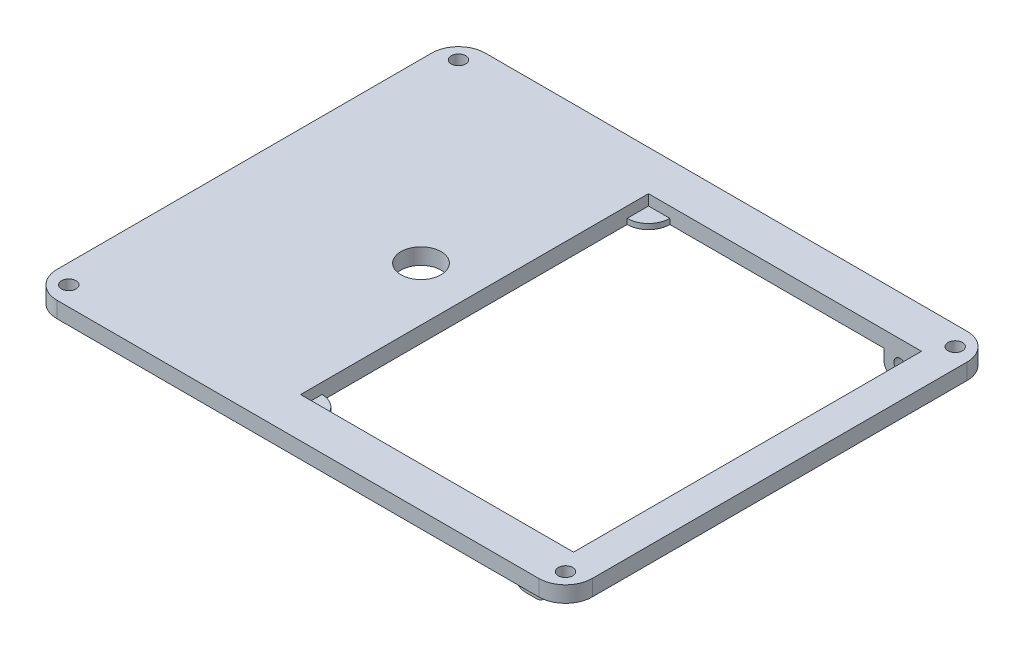
ISO-10303-21;
HEADER;
FILE_DESCRIPTION(('STEP AP214'),'2;1');
FILE_NAME('part.step','',(''),(''),'','','');
FILE_SCHEMA(('AUTOMOTIVE_DESIGN { 1 0 10303 214 1 1 1 1 }'));
ENDSEC;
DATA;
#1=APPLICATION_CONTEXT('core data for automotive mechanical design processes');
#2=APPLICATION_PROTOCOL_DEFINITION('international standard','automotive_design',2000,#1);
#3=PRODUCT_CONTEXT('',#1,'mechanical');
#4=PRODUCT('Part','Part','',(#3));
#5=PRODUCT_RELATED_PRODUCT_CATEGORY('part','',(#4));
#6=PRODUCT_DEFINITION_FORMATION('','',#4);
#7=PRODUCT_DEFINITION_CONTEXT('part definition',#1,'design');
#8=PRODUCT_DEFINITION('design','',#6,#7);
#9=PRODUCT_DEFINITION_SHAPE('','',#8);
#10=(LENGTH_UNIT() NAMED_UNIT(*) SI_UNIT(.MILLI.,.METRE.));
#11=(NAMED_UNIT(*) PLANE_ANGLE_UNIT() SI_UNIT($,.RADIAN.));
#12=(NAMED_UNIT(*) SI_UNIT($,.STERADIAN.) SOLID_ANGLE_UNIT());
#13=UNCERTAINTY_MEASURE_WITH_UNIT(LENGTH_MEASURE(1.E-05),#10,'distance_accuracy_value','');
#14=(GEOMETRIC_REPRESENTATION_CONTEXT(3) GLOBAL_UNCERTAINTY_ASSIGNED_CONTEXT((#13)) GLOBAL_UNIT_ASSIGNED_CONTEXT((#10,
#11,#12)) REPRESENTATION_CONTEXT('',''));
#15=CARTESIAN_POINT('',(0.,0.,0.));
#16=DIRECTION('',(0.,0.,1.));
#17=DIRECTION('',(1.,0.,0.));
#18=AXIS2_PLACEMENT_3D('',#15,#16,#17);
#19=CARTESIAN_POINT('',(40.,-1.3,36.5));
#20=DIRECTION('',(0.,0.,-1.));
#21=DIRECTION('',(-1.,0.,0.));
#22=AXIS2_PLACEMENT_3D('',#19,#20,#21);
#23=CYLINDRICAL_SURFACE('',#22,1.15);
#24=CARTESIAN_POINT('',(40.,-1.3,32.5));
#25=DIRECTION('',(0.,0.,1.));
#26=DIRECTION('',(1.,0.,0.));
#27=AXIS2_PLACEMENT_3D('',#24,#25,#26);
#28=CIRCLE('',#27,1.15);
#29=CARTESIAN_POINT('',(41.15,-1.3,32.5));
#30=VERTEX_POINT('',#29);
#31=EDGE_CURVE('E266',#30,#30,#28,.T.);
#32=ORIENTED_EDGE('',*,*,#31,.F.);
#33=EDGE_LOOP('',(#32));
#34=FACE_BOUND('',#33,.T.);
#35=CARTESIAN_POINT('',(40.,-1.3,34.5));
#36=DIRECTION('',(0.,0.,1.));
#37=DIRECTION('',(1.,0.,0.));
#38=AXIS2_PLACEMENT_3D('',#35,#36,#37);
#39=CIRCLE('',#38,1.15);
#40=CARTESIAN_POINT('',(41.15,-1.3,34.5));
#41=VERTEX_POINT('',#40);
#42=EDGE_CURVE('E241',#41,#41,#39,.T.);
#43=ORIENTED_EDGE('',*,*,#42,.T.);
#44=EDGE_LOOP('',(#43));
#45=FACE_BOUND('',#44,.T.);
#46=ADVANCED_FACE('F35',(#34,#45),#23,.F.);
#47=CARTESIAN_POINT('',(-45.,0.,35.));
#48=DIRECTION('',(0.,1.,0.));
#49=DIRECTION('',(0.,0.,1.));
#50=AXIS2_PLACEMENT_3D('',#47,#48,#49);
#51=PLANE('',#50);
#52=DIRECTION('',(-1.,0.,0.));
#53=VECTOR('',#52,1.);
#54=CARTESIAN_POINT('',(-6.99999999999999,0.,-32.5));
#55=LINE('',#54,#53);
#56=CARTESIAN_POINT('',(37.,0.,-32.5));
#57=VERTEX_POINT('',#56);
#58=CARTESIAN_POINT('',(-2.99999999999998,0.,-32.5));
#59=VERTEX_POINT('',#58);
#60=EDGE_CURVE('E362',#57,#59,#55,.T.);
#61=ORIENTED_EDGE('',*,*,#60,.T.);
#62=CARTESIAN_POINT('',(-6.99999999999998,0.,-32.5));
#63=DIRECTION('',(0.,-1.,0.));
#64=DIRECTION('',(0.,0.,1.));
#65=AXIS2_PLACEMENT_3D('',#62,#63,#64);
#66=CIRCLE('',#65,4.);
#67=CARTESIAN_POINT('',(-6.99999999999999,0.,-28.5));
#68=VERTEX_POINT('',#67);
#69=EDGE_CURVE('E50',#59,#68,#66,.T.);
#70=ORIENTED_EDGE('',*,*,#69,.T.);
#71=DIRECTION('',(0.,0.,1.));
#72=VECTOR('',#71,1.);
#73=CARTESIAN_POINT('',(-6.99999999999999,0.,-32.5));
#74=LINE('',#73,#72);
#75=CARTESIAN_POINT('',(-6.99999999999999,0.,28.5));
#76=VERTEX_POINT('',#75);
#77=EDGE_CURVE('E366',#68,#76,#74,.T.);
#78=ORIENTED_EDGE('',*,*,#77,.T.);
#79=CARTESIAN_POINT('',(-6.99999999999998,0.,32.5));
#80=DIRECTION('',(0.,-1.,0.));
#81=DIRECTION('',(0.,0.,-1.));
#82=AXIS2_PLACEMENT_3D('',#79,#80,#81);
#83=CIRCLE('',#82,4.);
#84=CARTESIAN_POINT('',(-2.99999999999998,0.,32.5));
#85=VERTEX_POINT('',#84);
#86=EDGE_CURVE('E56',#76,#85,#83,.T.);
#87=ORIENTED_EDGE('',*,*,#86,.T.);
#88=DIRECTION('',(1.,0.,0.));
#89=VECTOR('',#88,1.);
#90=CARTESIAN_POINT('',(-6.99999999999998,0.,32.5));
#91=LINE('',#90,#89);
#92=CARTESIAN_POINT('',(37.,0.,32.5));
#93=VERTEX_POINT('',#92);
#94=EDGE_CURVE('E352',#85,#93,#91,.T.);
#95=ORIENTED_EDGE('',*,*,#94,.T.);
#96=DIRECTION('',(0.,0.,1.));
#97=VECTOR('',#96,1.);
#98=CARTESIAN_POINT('',(37.,0.,32.5));
#99=LINE('',#98,#97);
#100=CARTESIAN_POINT('',(37.,0.,36.5));
#101=VERTEX_POINT('',#100);
#102=EDGE_CURVE('E276',#93,#101,#99,.T.);
#103=ORIENTED_EDGE('',*,*,#102,.T.);
#104=DIRECTION('',(1.,0.,0.));
#105=VECTOR('',#104,1.);
#106=CARTESIAN_POINT('',(43.,0.,36.5));
#107=LINE('',#106,#105);
#108=CARTESIAN_POINT('',(43.,0.,36.5));
#109=VERTEX_POINT('',#108);
#110=EDGE_CURVE('E282',#101,#109,#107,.T.);
#111=ORIENTED_EDGE('',*,*,#110,.T.);
#112=DIRECTION('',(0.,0.,-1.));
#113=VECTOR('',#112,1.);
#114=CARTESIAN_POINT('',(43.,0.,32.5));
#115=LINE('',#114,#113);
#116=CARTESIAN_POINT('',(43.,0.,32.5));
#117=VERTEX_POINT('',#116);
#118=EDGE_CURVE('E271',#109,#117,#115,.T.);
#119=ORIENTED_EDGE('',*,*,#118,.T.);
#120=CARTESIAN_POINT('',(44.,0.,32.5));
#121=VERTEX_POINT('',#120);
#122=EDGE_CURVE('E368',#117,#121,#91,.T.);
#123=ORIENTED_EDGE('',*,*,#122,.T.);
#124=DIRECTION('',(0.,0.,-1.));
#125=VECTOR('',#124,1.);
#126=CARTESIAN_POINT('',(44.,0.,-32.5));
#127=LINE('',#126,#125);
#128=CARTESIAN_POINT('',(44.,0.,-32.5));
#129=VERTEX_POINT('',#128);
#130=EDGE_CURVE('E346',#121,#129,#127,.T.);
#131=ORIENTED_EDGE('',*,*,#130,.T.);
#132=CARTESIAN_POINT('',(43.,0.,-32.5));
#133=VERTEX_POINT('',#132);
#134=EDGE_CURVE('E363',#129,#133,#55,.T.);
#135=ORIENTED_EDGE('',*,*,#134,.T.);
#136=DIRECTION('',(0.,0.,1.));
#137=VECTOR('',#136,1.);
#138=CARTESIAN_POINT('',(43.,0.,-32.5));
#139=LINE('',#138,#137);
#140=CARTESIAN_POINT('',(43.,0.,-36.5));
#141=VERTEX_POINT('',#140);
#142=EDGE_CURVE('E299',#141,#133,#139,.T.);
#143=ORIENTED_EDGE('',*,*,#142,.F.);
#144=DIRECTION('',(1.,0.,0.));
#145=VECTOR('',#144,1.);
#146=CARTESIAN_POINT('',(43.,0.,-36.5));
#147=LINE('',#146,#145);
#148=CARTESIAN_POINT('',(37.,0.,-36.5));
#149=VERTEX_POINT('',#148);
#150=EDGE_CURVE('E306',#149,#141,#147,.T.);
#151=ORIENTED_EDGE('',*,*,#150,.F.);
#152=DIRECTION('',(0.,0.,-1.));
#153=VECTOR('',#152,1.);
#154=CARTESIAN_POINT('',(37.,0.,-32.5));
#155=LINE('',#154,#153);
#156=EDGE_CURVE('E312',#57,#149,#155,.T.);
#157=ORIENTED_EDGE('',*,*,#156,.F.);
#158=EDGE_LOOP('',(#61,#70,#78,#87,#95,#103,#111,#119,#123,#131,#135,#143,#151,#157));
#159=FACE_BOUND('',#158,.T.);
#160=CARTESIAN_POINT('',(-17.,0.,0.));
#161=DIRECTION('',(0.,1.,0.));
#162=DIRECTION('',(0.,0.,1.));
#163=AXIS2_PLACEMENT_3D('',#160,#161,#162);
#164=CIRCLE('',#163,3.75);
#165=CARTESIAN_POINT('',(-17.,0.,3.75));
#166=VERTEX_POINT('',#165);
#167=EDGE_CURVE('E263',#166,#166,#164,.T.);
#168=ORIENTED_EDGE('',*,*,#167,.T.);
#169=EDGE_LOOP('',(#168));
#170=FACE_BOUND('',#169,.T.);
#171=CARTESIAN_POINT('',(-46.4,0.,36.4));
#172=DIRECTION('',(0.,1.,0.));
#173=DIRECTION('',(0.,0.,-1.));
#174=AXIS2_PLACEMENT_3D('',#171,#172,#173);
#175=CIRCLE('',#174,1.35);
#176=CARTESIAN_POINT('',(-46.4,0.,35.05));
#177=VERTEX_POINT('',#176);
#178=EDGE_CURVE('E324',#177,#177,#175,.T.);
#179=ORIENTED_EDGE('',*,*,#178,.T.);
#180=EDGE_LOOP('',(#179));
#181=FACE_BOUND('',#180,.T.);
#182=CARTESIAN_POINT('',(46.4,0.,36.4));
#183=DIRECTION('',(0.,1.,0.));
#184=DIRECTION('',(0.,0.,1.));
#185=AXIS2_PLACEMENT_3D('',#182,#183,#184);
#186=CIRCLE('',#185,1.35);
#187=CARTESIAN_POINT('',(46.4,0.,37.75));
#188=VERTEX_POINT('',#187);
#189=EDGE_CURVE('E328',#188,#188,#186,.T.);
#190=ORIENTED_EDGE('',*,*,#189,.T.);
#191=EDGE_LOOP('',(#190));
#192=FACE_BOUND('',#191,.T.);
#193=CARTESIAN_POINT('',(46.4,0.,-36.4));
#194=DIRECTION('',(0.,1.,0.));
#195=DIRECTION('',(0.,0.,-1.));
#196=AXIS2_PLACEMENT_3D('',#193,#194,#195);
#197=CIRCLE('',#196,1.35);
#198=CARTESIAN_POINT('',(46.4,0.,-37.75));
#199=VERTEX_POINT('',#198);
#200=EDGE_CURVE('E334',#199,#199,#197,.T.);
#201=ORIENTED_EDGE('',*,*,#200,.T.);
#202=EDGE_LOOP('',(#201));
#203=FACE_BOUND('',#202,.T.);
#204=CARTESIAN_POINT('',(-46.4,0.,-36.4));
#205=DIRECTION('',(0.,1.,0.));
#206=DIRECTION('',(0.,0.,1.));
#207=AXIS2_PLACEMENT_3D('',#204,#205,#206);
#208=CIRCLE('',#207,1.35);
#209=CARTESIAN_POINT('',(-46.4,0.,-35.05));
#210=VERTEX_POINT('',#209);
#211=EDGE_CURVE('E340',#210,#210,#208,.T.);
#212=ORIENTED_EDGE('',*,*,#211,.T.);
#213=EDGE_LOOP('',(#212));
#214=FACE_BOUND('',#213,.T.);
#215=CARTESIAN_POINT('',(-45.,0.,35.));
#216=DIRECTION('',(0.,1.,0.));
#217=DIRECTION('',(0.,0.,1.));
#218=AXIS2_PLACEMENT_3D('',#215,#216,#217);
#219=CIRCLE('',#218,5.);
#220=CARTESIAN_POINT('',(-50.,0.,35.));
#221=VERTEX_POINT('',#220);
#222=CARTESIAN_POINT('',(-45.,0.,40.));
#223=VERTEX_POINT('',#222);
#224=EDGE_CURVE('E379',#221,#223,#219,.T.);
#225=ORIENTED_EDGE('',*,*,#224,.F.);
#226=DIRECTION('',(0.,0.,1.));
#227=VECTOR('',#226,1.);
#228=CARTESIAN_POINT('',(-50.,0.,-35.));
#229=LINE('',#228,#227);
#230=CARTESIAN_POINT('',(-50.,0.,-35.));
#231=VERTEX_POINT('',#230);
#232=EDGE_CURVE('E384',#231,#221,#229,.T.);
#233=ORIENTED_EDGE('',*,*,#232,.F.);
#234=CARTESIAN_POINT('',(-45.,0.,-35.));
#235=DIRECTION('',(0.,1.,0.));
#236=DIRECTION('',(0.,0.,1.));
#237=AXIS2_PLACEMENT_3D('',#234,#235,#236);
#238=CIRCLE('',#237,5.);
#239=CARTESIAN_POINT('',(-45.,0.,-40.));
#240=VERTEX_POINT('',#239);
#241=EDGE_CURVE('E411',#240,#231,#238,.T.);
#242=ORIENTED_EDGE('',*,*,#241,.F.);
#243=DIRECTION('',(-1.,0.,0.));
#244=VECTOR('',#243,1.);
#245=CARTESIAN_POINT('',(-45.,0.,-40.));
#246=LINE('',#245,#244);
#247=CARTESIAN_POINT('',(45.,0.,-40.));
#248=VERTEX_POINT('',#247);
#249=EDGE_CURVE('E409',#248,#240,#246,.T.);
#250=ORIENTED_EDGE('',*,*,#249,.F.);
#251=CARTESIAN_POINT('',(45.,0.,-35.));
#252=DIRECTION('',(0.,1.,0.));
#253=DIRECTION('',(0.,0.,-1.));
#254=AXIS2_PLACEMENT_3D('',#251,#252,#253);
#255=CIRCLE('',#254,5.);
#256=CARTESIAN_POINT('',(50.,0.,-35.));
#257=VERTEX_POINT('',#256);
#258=EDGE_CURVE('E407',#257,#248,#255,.T.);
#259=ORIENTED_EDGE('',*,*,#258,.F.);
#260=DIRECTION('',(0.,0.,-1.));
#261=VECTOR('',#260,1.);
#262=CARTESIAN_POINT('',(50.,0.,-35.));
#263=LINE('',#262,#261);
#264=CARTESIAN_POINT('',(50.,0.,35.));
#265=VERTEX_POINT('',#264);
#266=EDGE_CURVE('E405',#265,#257,#263,.T.);
#267=ORIENTED_EDGE('',*,*,#266,.F.);
#268=CARTESIAN_POINT('',(45.,0.,35.));
#269=DIRECTION('',(0.,1.,0.));
#270=DIRECTION('',(0.,0.,1.));
#271=AXIS2_PLACEMENT_3D('',#268,#269,#270);
#272=CIRCLE('',#271,5.);
#273=CARTESIAN_POINT('',(45.,0.,40.));
#274=VERTEX_POINT('',#273);
#275=EDGE_CURVE('E403',#274,#265,#272,.T.);
#276=ORIENTED_EDGE('',*,*,#275,.F.);
#277=DIRECTION('',(1.,0.,0.));
#278=VECTOR('',#277,1.);
#279=CARTESIAN_POINT('',(-45.,0.,40.));
#280=LINE('',#279,#278);
#281=EDGE_CURVE('E401',#223,#274,#280,.T.);
#282=ORIENTED_EDGE('',*,*,#281,.F.);
#283=EDGE_LOOP('',(#225,#233,#242,#250,#259,#267,#276,#282));
#284=FACE_BOUND('',#283,.T.);
#285=ADVANCED_FACE('F499',(#159,#170,#181,#192,#203,#214,#284),#51,.F.);
#286=CARTESIAN_POINT('',(-45.,3.,35.));
#287=DIRECTION('',(0.,1.,0.));
#288=DIRECTION('',(0.,0.,1.));
#289=AXIS2_PLACEMENT_3D('',#286,#287,#288);
#290=PLANE('',#289);
#291=CARTESIAN_POINT('',(-17.,3.,0.));
#292=DIRECTION('',(0.,1.,0.));
#293=DIRECTION('',(0.,0.,1.));
#294=AXIS2_PLACEMENT_3D('',#291,#292,#293);
#295=CIRCLE('',#294,3.75);
#296=CARTESIAN_POINT('',(-17.,3.,3.75));
#297=VERTEX_POINT('',#296);
#298=EDGE_CURVE('E260',#297,#297,#295,.T.);
#299=ORIENTED_EDGE('',*,*,#298,.F.);
#300=EDGE_LOOP('',(#299));
#301=FACE_BOUND('',#300,.T.);
#302=CARTESIAN_POINT('',(46.4,3.,36.4));
#303=DIRECTION('',(0.,1.,0.));
#304=DIRECTION('',(0.,0.,1.));
#305=AXIS2_PLACEMENT_3D('',#302,#303,#304);
#306=CIRCLE('',#305,1.35);
#307=CARTESIAN_POINT('',(46.4,3.,37.75));
#308=VERTEX_POINT('',#307);
#309=EDGE_CURVE('E331',#308,#308,#306,.T.);
#310=ORIENTED_EDGE('',*,*,#309,.F.);
#311=EDGE_LOOP('',(#310));
#312=FACE_BOUND('',#311,.T.);
#313=CARTESIAN_POINT('',(-46.4,3.,-36.4));
#314=DIRECTION('',(0.,1.,0.));
#315=DIRECTION('',(0.,0.,1.));
#316=AXIS2_PLACEMENT_3D('',#313,#314,#315);
#317=CIRCLE('',#316,1.35);
#318=CARTESIAN_POINT('',(-46.4,3.,-35.05));
#319=VERTEX_POINT('',#318);
#320=EDGE_CURVE('E343',#319,#319,#317,.T.);
#321=ORIENTED_EDGE('',*,*,#320,.F.);
#322=EDGE_LOOP('',(#321));
#323=FACE_BOUND('',#322,.T.);
#324=CARTESIAN_POINT('',(-45.,3.,35.));
#325=DIRECTION('',(0.,1.,0.));
#326=DIRECTION('',(0.,0.,1.));
#327=AXIS2_PLACEMENT_3D('',#324,#325,#326);
#328=CIRCLE('',#327,5.);
#329=CARTESIAN_POINT('',(-50.,3.,35.));
#330=VERTEX_POINT('',#329);
#331=CARTESIAN_POINT('',(-45.,3.,40.));
#332=VERTEX_POINT('',#331);
#333=EDGE_CURVE('E380',#330,#332,#328,.T.);
#334=ORIENTED_EDGE('',*,*,#333,.T.);
#335=DIRECTION('',(1.,0.,0.));
#336=VECTOR('',#335,1.);
#337=CARTESIAN_POINT('',(-45.,3.,40.));
#338=LINE('',#337,#336);
#339=CARTESIAN_POINT('',(45.,3.,40.));
#340=VERTEX_POINT('',#339);
#341=EDGE_CURVE('E383',#332,#340,#338,.T.);
#342=ORIENTED_EDGE('',*,*,#341,.T.);
#343=CARTESIAN_POINT('',(45.,3.,35.));
#344=DIRECTION('',(0.,1.,0.));
#345=DIRECTION('',(0.,0.,1.));
#346=AXIS2_PLACEMENT_3D('',#343,#344,#345);
#347=CIRCLE('',#346,5.);
#348=CARTESIAN_POINT('',(50.,3.,35.));
#349=VERTEX_POINT('',#348);
#350=EDGE_CURVE('E386',#340,#349,#347,.T.);
#351=ORIENTED_EDGE('',*,*,#350,.T.);
#352=DIRECTION('',(0.,0.,-1.));
#353=VECTOR('',#352,1.);
#354=CARTESIAN_POINT('',(50.,3.,-35.));
#355=LINE('',#354,#353);
#356=CARTESIAN_POINT('',(50.,3.,-35.));
#357=VERTEX_POINT('',#356);
#358=EDGE_CURVE('E388',#349,#357,#355,.T.);
#359=ORIENTED_EDGE('',*,*,#358,.T.);
#360=CARTESIAN_POINT('',(45.,3.,-35.));
#361=DIRECTION('',(0.,1.,0.));
#362=DIRECTION('',(0.,0.,-1.));
#363=AXIS2_PLACEMENT_3D('',#360,#361,#362);
#364=CIRCLE('',#363,5.);
#365=CARTESIAN_POINT('',(45.,3.,-40.));
#366=VERTEX_POINT('',#365);
#367=EDGE_CURVE('E390',#357,#366,#364,.T.);
#368=ORIENTED_EDGE('',*,*,#367,.T.);
#369=DIRECTION('',(-1.,0.,0.));
#370=VECTOR('',#369,1.);
#371=CARTESIAN_POINT('',(-45.,3.,-40.));
#372=LINE('',#371,#370);
#373=CARTESIAN_POINT('',(-45.,3.,-40.));
#374=VERTEX_POINT('',#373);
#375=EDGE_CURVE('E392',#366,#374,#372,.T.);
#376=ORIENTED_EDGE('',*,*,#375,.T.);
#377=CARTESIAN_POINT('',(-45.,3.,-35.));
#378=DIRECTION('',(0.,1.,0.));
#379=DIRECTION('',(0.,0.,1.));
#380=AXIS2_PLACEMENT_3D('',#377,#378,#379);
#381=CIRCLE('',#380,5.);
#382=CARTESIAN_POINT('',(-50.,3.,-35.));
#383=VERTEX_POINT('',#382);
#384=EDGE_CURVE('E394',#374,#383,#381,.T.);
#385=ORIENTED_EDGE('',*,*,#384,.T.);
#386=DIRECTION('',(0.,0.,1.));
#387=VECTOR('',#386,1.);
#388=CARTESIAN_POINT('',(-50.,3.,-35.));
#389=LINE('',#388,#387);
#390=EDGE_CURVE('E396',#383,#330,#389,.T.);
#391=ORIENTED_EDGE('',*,*,#390,.T.);
#392=EDGE_LOOP('',(#334,#342,#351,#359,#368,#376,#385,#391));
#393=FACE_BOUND('',#392,.T.);
#394=DIRECTION('',(-1.,0.,0.));
#395=VECTOR('',#394,1.);
#396=CARTESIAN_POINT('',(-6.99999999999999,3.,-32.5));
#397=LINE('',#396,#395);
#398=CARTESIAN_POINT('',(44.,3.,-32.5));
#399=VERTEX_POINT('',#398);
#400=CARTESIAN_POINT('',(-6.99999999999999,3.,-32.5));
#401=VERTEX_POINT('',#400);
#402=EDGE_CURVE('E351',#399,#401,#397,.T.);
#403=ORIENTED_EDGE('',*,*,#402,.F.);
#404=DIRECTION('',(0.,0.,-1.));
#405=VECTOR('',#404,1.);
#406=CARTESIAN_POINT('',(44.,3.,-32.5));
#407=LINE('',#406,#405);
#408=CARTESIAN_POINT('',(44.,3.,32.5));
#409=VERTEX_POINT('',#408);
#410=EDGE_CURVE('E349',#409,#399,#407,.T.);
#411=ORIENTED_EDGE('',*,*,#410,.F.);
#412=DIRECTION('',(1.,0.,0.));
#413=VECTOR('',#412,1.);
#414=CARTESIAN_POINT('',(-6.99999999999998,3.,32.5));
#415=LINE('',#414,#413);
#416=CARTESIAN_POINT('',(-6.99999999999998,3.,32.5));
#417=VERTEX_POINT('',#416);
#418=EDGE_CURVE('E357',#417,#409,#415,.T.);
#419=ORIENTED_EDGE('',*,*,#418,.F.);
#420=DIRECTION('',(0.,0.,1.));
#421=VECTOR('',#420,1.);
#422=CARTESIAN_POINT('',(-6.99999999999999,3.,-32.5));
#423=LINE('',#422,#421);
#424=EDGE_CURVE('E354',#401,#417,#423,.T.);
#425=ORIENTED_EDGE('',*,*,#424,.F.);
#426=EDGE_LOOP('',(#403,#411,#419,#425));
#427=FACE_BOUND('',#426,.T.);
#428=CARTESIAN_POINT('',(46.4,3.,-36.4));
#429=DIRECTION('',(0.,1.,0.));
#430=DIRECTION('',(0.,0.,-1.));
#431=AXIS2_PLACEMENT_3D('',#428,#429,#430);
#432=CIRCLE('',#431,1.35);
#433=CARTESIAN_POINT('',(46.4,3.,-37.75));
#434=VERTEX_POINT('',#433);
#435=EDGE_CURVE('E337',#434,#434,#432,.T.);
#436=ORIENTED_EDGE('',*,*,#435,.F.);
#437=EDGE_LOOP('',(#436));
#438=FACE_BOUND('',#437,.T.);
#439=CARTESIAN_POINT('',(-46.4,3.,36.4));
#440=DIRECTION('',(0.,1.,0.));
#441=DIRECTION('',(0.,0.,-1.));
#442=AXIS2_PLACEMENT_3D('',#439,#440,#441);
#443=CIRCLE('',#442,1.35);
#444=CARTESIAN_POINT('',(-46.4,3.,35.05));
#445=VERTEX_POINT('',#444);
#446=EDGE_CURVE('E325',#445,#445,#443,.T.);
#447=ORIENTED_EDGE('',*,*,#446,.F.);
#448=EDGE_LOOP('',(#447));
#449=FACE_BOUND('',#448,.T.);
#450=ADVANCED_FACE('F519',(#301,#312,#323,#393,#427,#438,#449),#290,.T.);
#451=CARTESIAN_POINT('',(-45.,3.,35.));
#452=DIRECTION('',(0.,-1.,0.));
#453=DIRECTION('',(0.,0.,-1.));
#454=AXIS2_PLACEMENT_3D('',#451,#452,#453);
#455=CYLINDRICAL_SURFACE('',#454,5.);
#456=ORIENTED_EDGE('',*,*,#224,.T.);
#457=DIRECTION('',(0.,-1.,0.));
#458=VECTOR('',#457,1.);
#459=CARTESIAN_POINT('',(-45.,3.,40.));
#460=LINE('',#459,#458);
#461=EDGE_CURVE('E434',#332,#223,#460,.T.);
#462=ORIENTED_EDGE('',*,*,#461,.F.);
#463=ORIENTED_EDGE('',*,*,#333,.F.);
#464=DIRECTION('',(0.,-1.,0.));
#465=VECTOR('',#464,1.);
#466=CARTESIAN_POINT('',(-50.,3.,35.));
#467=LINE('',#466,#465);
#468=EDGE_CURVE('E398',#330,#221,#467,.T.);
#469=ORIENTED_EDGE('',*,*,#468,.T.);
#470=EDGE_LOOP('',(#456,#462,#463,#469));
#471=FACE_BOUND('',#470,.T.);
#472=ADVANCED_FACE('F797',(#471),#455,.T.);
#473=CARTESIAN_POINT('',(-45.,3.,40.));
#474=DIRECTION('',(0.,0.,-1.));
#475=DIRECTION('',(-1.,0.,0.));
#476=AXIS2_PLACEMENT_3D('',#473,#474,#475);
#477=PLANE('',#476);
#478=ORIENTED_EDGE('',*,*,#281,.T.);
#479=DIRECTION('',(0.,-1.,0.));
#480=VECTOR('',#479,1.);
#481=CARTESIAN_POINT('',(45.,3.,40.));
#482=LINE('',#481,#480);
#483=EDGE_CURVE('E431',#340,#274,#482,.T.);
#484=ORIENTED_EDGE('',*,*,#483,.F.);
#485=ORIENTED_EDGE('',*,*,#341,.F.);
#486=ORIENTED_EDGE('',*,*,#461,.T.);
#487=EDGE_LOOP('',(#478,#484,#485,#486));
#488=FACE_BOUND('',#487,.T.);
#489=ADVANCED_FACE('F822',(#488),#477,.F.);
#490=CARTESIAN_POINT('',(45.,3.,35.));
#491=DIRECTION('',(0.,-1.,0.));
#492=DIRECTION('',(0.,0.,-1.));
#493=AXIS2_PLACEMENT_3D('',#490,#491,#492);
#494=CYLINDRICAL_SURFACE('',#493,5.);
#495=ORIENTED_EDGE('',*,*,#275,.T.);
#496=DIRECTION('',(0.,-1.,0.));
#497=VECTOR('',#496,1.);
#498=CARTESIAN_POINT('',(50.,3.,35.));
#499=LINE('',#498,#497);
#500=EDGE_CURVE('E428',#349,#265,#499,.T.);
#501=ORIENTED_EDGE('',*,*,#500,.F.);
#502=ORIENTED_EDGE('',*,*,#350,.F.);
#503=ORIENTED_EDGE('',*,*,#483,.T.);
#504=EDGE_LOOP('',(#495,#501,#502,#503));
#505=FACE_BOUND('',#504,.T.);
#506=ADVANCED_FACE('F818',(#505),#494,.T.);
#507=CARTESIAN_POINT('',(50.,3.,-35.));
#508=DIRECTION('',(-1.,0.,0.));
#509=DIRECTION('',(0.,0.,1.));
#510=AXIS2_PLACEMENT_3D('',#507,#508,#509);
#511=PLANE('',#510);
#512=ORIENTED_EDGE('',*,*,#266,.T.);
#513=DIRECTION('',(0.,-1.,0.));
#514=VECTOR('',#513,1.);
#515=CARTESIAN_POINT('',(50.,3.,-35.));
#516=LINE('',#515,#514);
#517=EDGE_CURVE('E425',#357,#257,#516,.T.);
#518=ORIENTED_EDGE('',*,*,#517,.F.);
#519=ORIENTED_EDGE('',*,*,#358,.F.);
#520=ORIENTED_EDGE('',*,*,#500,.T.);
#521=EDGE_LOOP('',(#512,#518,#519,#520));
#522=FACE_BOUND('',#521,.T.);
#523=ADVANCED_FACE('F814',(#522),#511,.F.);
#524=CARTESIAN_POINT('',(45.,3.,-35.));
#525=DIRECTION('',(0.,-1.,0.));
#526=DIRECTION('',(0.,0.,-1.));
#527=AXIS2_PLACEMENT_3D('',#524,#525,#526);
#528=CYLINDRICAL_SURFACE('',#527,5.);
#529=ORIENTED_EDGE('',*,*,#258,.T.);
#530=DIRECTION('',(0.,-1.,0.));
#531=VECTOR('',#530,1.);
#532=CARTESIAN_POINT('',(45.,3.,-40.));
#533=LINE('',#532,#531);
#534=EDGE_CURVE('E422',#366,#248,#533,.T.);
#535=ORIENTED_EDGE('',*,*,#534,.F.);
#536=ORIENTED_EDGE('',*,*,#367,.F.);
#537=ORIENTED_EDGE('',*,*,#517,.T.);
#538=EDGE_LOOP('',(#529,#535,#536,#537));
#539=FACE_BOUND('',#538,.T.);
#540=ADVANCED_FACE('F810',(#539),#528,.T.);
#541=CARTESIAN_POINT('',(-45.,3.,-40.));
#542=DIRECTION('',(0.,0.,1.));
#543=DIRECTION('',(1.,0.,0.));
#544=AXIS2_PLACEMENT_3D('',#541,#542,#543);
#545=PLANE('',#544);
#546=ORIENTED_EDGE('',*,*,#249,.T.);
#547=DIRECTION('',(0.,-1.,0.));
#548=VECTOR('',#547,1.);
#549=CARTESIAN_POINT('',(-45.,3.,-40.));
#550=LINE('',#549,#548);
#551=EDGE_CURVE('E419',#374,#240,#550,.T.);
#552=ORIENTED_EDGE('',*,*,#551,.F.);
#553=ORIENTED_EDGE('',*,*,#375,.F.);
#554=ORIENTED_EDGE('',*,*,#534,.T.);
#555=EDGE_LOOP('',(#546,#552,#553,#554));
#556=FACE_BOUND('',#555,.T.);
#557=ADVANCED_FACE('F806',(#556),#545,.F.);
#558=CARTESIAN_POINT('',(-45.,3.,-35.));
#559=DIRECTION('',(0.,-1.,0.));
#560=DIRECTION('',(0.,0.,-1.));
#561=AXIS2_PLACEMENT_3D('',#558,#559,#560);
#562=CYLINDRICAL_SURFACE('',#561,5.);
#563=ORIENTED_EDGE('',*,*,#241,.T.);
#564=DIRECTION('',(0.,-1.,0.));
#565=VECTOR('',#564,1.);
#566=CARTESIAN_POINT('',(-50.,3.,-35.));
#567=LINE('',#566,#565);
#568=EDGE_CURVE('E416',#383,#231,#567,.T.);
#569=ORIENTED_EDGE('',*,*,#568,.F.);
#570=ORIENTED_EDGE('',*,*,#384,.F.);
#571=ORIENTED_EDGE('',*,*,#551,.T.);
#572=EDGE_LOOP('',(#563,#569,#570,#571));
#573=FACE_BOUND('',#572,.T.);
#574=ADVANCED_FACE('F802',(#573),#562,.T.);
#575=CARTESIAN_POINT('',(-50.,3.,-35.));
#576=DIRECTION('',(1.,0.,0.));
#577=DIRECTION('',(0.,0.,-1.));
#578=AXIS2_PLACEMENT_3D('',#575,#576,#577);
#579=PLANE('',#578);
#580=ORIENTED_EDGE('',*,*,#232,.T.);
#581=ORIENTED_EDGE('',*,*,#468,.F.);
#582=ORIENTED_EDGE('',*,*,#390,.F.);
#583=ORIENTED_EDGE('',*,*,#568,.T.);
#584=EDGE_LOOP('',(#580,#581,#582,#583));
#585=FACE_BOUND('',#584,.T.);
#586=ADVANCED_FACE('F796',(#585),#579,.F.);
#587=CARTESIAN_POINT('',(44.,3.,-32.5));
#588=DIRECTION('',(-1.,0.,0.));
#589=DIRECTION('',(0.,0.,1.));
#590=AXIS2_PLACEMENT_3D('',#587,#588,#589);
#591=PLANE('',#590);
#592=ORIENTED_EDGE('',*,*,#130,.F.);
#593=DIRECTION('',(0.,-1.,0.));
#594=VECTOR('',#593,1.);
#595=CARTESIAN_POINT('',(44.,3.,32.5));
#596=LINE('',#595,#594);
#597=EDGE_CURVE('E359',#409,#121,#596,.T.);
#598=ORIENTED_EDGE('',*,*,#597,.F.);
#599=ORIENTED_EDGE('',*,*,#410,.T.);
#600=DIRECTION('',(0.,-1.,0.));
#601=VECTOR('',#600,1.);
#602=CARTESIAN_POINT('',(44.,3.,-32.5));
#603=LINE('',#602,#601);
#604=EDGE_CURVE('E376',#399,#129,#603,.T.);
#605=ORIENTED_EDGE('',*,*,#604,.T.);
#606=EDGE_LOOP('',(#592,#598,#599,#605));
#607=FACE_BOUND('',#606,.T.);
#608=ADVANCED_FACE('F516',(#607),#591,.T.);
#609=CARTESIAN_POINT('',(-6.99999999999999,3.,-32.5));
#610=DIRECTION('',(0.,0.,1.));
#611=DIRECTION('',(1.,0.,0.));
#612=AXIS2_PLACEMENT_3D('',#609,#610,#611);
#613=PLANE('',#612);
#614=DIRECTION('',(0.,-1.,0.));
#615=VECTOR('',#614,1.);
#616=CARTESIAN_POINT('',(-2.99999999999998,1.,-32.5));
#617=LINE('',#616,#615);
#618=CARTESIAN_POINT('',(-2.99999999999998,1.,-32.5));
#619=VERTEX_POINT('',#618);
#620=EDGE_CURVE('E218',#619,#59,#617,.T.);
#621=ORIENTED_EDGE('',*,*,#620,.T.);
#622=ORIENTED_EDGE('',*,*,#60,.F.);
#623=DIRECTION('',(0.,1.,0.));
#624=VECTOR('',#623,1.);
#625=CARTESIAN_POINT('',(37.,-4.,-32.5));
#626=LINE('',#625,#624);
#627=CARTESIAN_POINT('',(37.,-2.,-32.5));
#628=VERTEX_POINT('',#627);
#629=EDGE_CURVE('E320',#628,#57,#626,.T.);
#630=ORIENTED_EDGE('',*,*,#629,.F.);
#631=CARTESIAN_POINT('',(39.,-2.,-32.5));
#632=DIRECTION('',(0.,0.,1.));
#633=DIRECTION('',(1.,0.,0.));
#634=AXIS2_PLACEMENT_3D('',#631,#632,#633);
#635=CIRCLE('',#634,2.);
#636=CARTESIAN_POINT('',(39.,-4.,-32.5));
#637=VERTEX_POINT('',#636);
#638=EDGE_CURVE('E443',#628,#637,#635,.T.);
#639=ORIENTED_EDGE('',*,*,#638,.T.);
#640=DIRECTION('',(-1.,0.,0.));
#641=VECTOR('',#640,1.);
#642=CARTESIAN_POINT('',(43.,-4.,-32.5));
#643=LINE('',#642,#641);
#644=CARTESIAN_POINT('',(41.,-4.,-32.5));
#645=VERTEX_POINT('',#644);
#646=EDGE_CURVE('E302',#645,#637,#643,.T.);
#647=ORIENTED_EDGE('',*,*,#646,.F.);
#648=CARTESIAN_POINT('',(41.,-2.,-32.5));
#649=DIRECTION('',(0.,0.,1.));
#650=DIRECTION('',(1.,0.,0.));
#651=AXIS2_PLACEMENT_3D('',#648,#649,#650);
#652=CIRCLE('',#651,2.);
#653=CARTESIAN_POINT('',(43.,-2.,-32.5));
#654=VERTEX_POINT('',#653);
#655=EDGE_CURVE('E445',#645,#654,#652,.T.);
#656=ORIENTED_EDGE('',*,*,#655,.T.);
#657=DIRECTION('',(0.,1.,0.));
#658=VECTOR('',#657,1.);
#659=CARTESIAN_POINT('',(43.,-4.,-32.5));
#660=LINE('',#659,#658);
#661=EDGE_CURVE('E322',#654,#133,#660,.T.);
#662=ORIENTED_EDGE('',*,*,#661,.T.);
#663=ORIENTED_EDGE('',*,*,#134,.F.);
#664=ORIENTED_EDGE('',*,*,#604,.F.);
#665=ORIENTED_EDGE('',*,*,#402,.T.);
#666=DIRECTION('',(0.,-1.,0.));
#667=VECTOR('',#666,1.);
#668=CARTESIAN_POINT('',(-6.99999999999999,3.,-32.5));
#669=LINE('',#668,#667);
#670=CARTESIAN_POINT('',(-6.99999999999998,1.,-32.5));
#671=VERTEX_POINT('',#670);
#672=EDGE_CURVE('E239',#401,#671,#669,.T.);
#673=ORIENTED_EDGE('',*,*,#672,.T.);
#674=DIRECTION('',(1.,0.,0.));
#675=VECTOR('',#674,1.);
#676=CARTESIAN_POINT('',(-6.99999999999998,1.,-32.5));
#677=LINE('',#676,#675);
#678=EDGE_CURVE('E231',#671,#619,#677,.T.);
#679=ORIENTED_EDGE('',*,*,#678,.T.);
#680=EDGE_LOOP('',(#621,#622,#630,#639,#647,#656,#662,#663,#664,#665,#673,#679));
#681=FACE_BOUND('',#680,.T.);
#682=CARTESIAN_POINT('',(40.,-1.3,-32.5));
#683=DIRECTION('',(0.,0.,1.));
#684=DIRECTION('',(1.,0.,0.));
#685=AXIS2_PLACEMENT_3D('',#682,#683,#684);
#686=CIRCLE('',#685,1.15);
#687=CARTESIAN_POINT('',(41.15,-1.3,-32.5));
#688=VERTEX_POINT('',#687);
#689=EDGE_CURVE('E295',#688,#688,#686,.T.);
#690=ORIENTED_EDGE('',*,*,#689,.F.);
#691=EDGE_LOOP('',(#690));
#692=FACE_BOUND('',#691,.T.);
#693=ADVANCED_FACE('F236',(#681,#692),#613,.T.);
#694=CARTESIAN_POINT('',(-6.99999999999999,3.,-32.5));
#695=DIRECTION('',(1.,0.,0.));
#696=DIRECTION('',(0.,0.,-1.));
#697=AXIS2_PLACEMENT_3D('',#694,#695,#696);
#698=PLANE('',#697);
#699=DIRECTION('',(0.,-1.,0.));
#700=VECTOR('',#699,1.);
#701=CARTESIAN_POINT('',(-6.99999999999999,1.,-28.5));
#702=LINE('',#701,#700);
#703=CARTESIAN_POINT('',(-6.99999999999999,1.,-28.5));
#704=VERTEX_POINT('',#703);
#705=EDGE_CURVE('E226',#704,#68,#702,.T.);
#706=ORIENTED_EDGE('',*,*,#705,.F.);
#707=DIRECTION('',(0.,0.,-1.));
#708=VECTOR('',#707,1.);
#709=CARTESIAN_POINT('',(-6.99999999999999,1.,-28.5));
#710=LINE('',#709,#708);
#711=EDGE_CURVE('E227',#704,#671,#710,.T.);
#712=ORIENTED_EDGE('',*,*,#711,.T.);
#713=ORIENTED_EDGE('',*,*,#672,.F.);
#714=ORIENTED_EDGE('',*,*,#424,.T.);
#715=DIRECTION('',(0.,-1.,0.));
#716=VECTOR('',#715,1.);
#717=CARTESIAN_POINT('',(-6.99999999999998,3.,32.5));
#718=LINE('',#717,#716);
#719=CARTESIAN_POINT('',(-6.99999999999998,1.,32.5));
#720=VERTEX_POINT('',#719);
#721=EDGE_CURVE('E372',#417,#720,#718,.T.);
#722=ORIENTED_EDGE('',*,*,#721,.T.);
#723=DIRECTION('',(0.,0.,-1.));
#724=VECTOR('',#723,1.);
#725=CARTESIAN_POINT('',(-6.99999999999999,1.,28.5));
#726=LINE('',#725,#724);
#727=CARTESIAN_POINT('',(-6.99999999999999,1.,28.5));
#728=VERTEX_POINT('',#727);
#729=EDGE_CURVE('E250',#720,#728,#726,.T.);
#730=ORIENTED_EDGE('',*,*,#729,.T.);
#731=DIRECTION('',(0.,-1.,0.));
#732=VECTOR('',#731,1.);
#733=CARTESIAN_POINT('',(-6.99999999999999,1.,28.5));
#734=LINE('',#733,#732);
#735=EDGE_CURVE('E256',#728,#76,#734,.T.);
#736=ORIENTED_EDGE('',*,*,#735,.T.);
#737=ORIENTED_EDGE('',*,*,#77,.F.);
#738=EDGE_LOOP('',(#706,#712,#713,#714,#722,#730,#736,#737));
#739=FACE_BOUND('',#738,.T.);
#740=ADVANCED_FACE('F507',(#739),#698,.T.);
#741=CARTESIAN_POINT('',(-6.99999999999998,3.,32.5));
#742=DIRECTION('',(0.,0.,-1.));
#743=DIRECTION('',(-1.,0.,0.));
#744=AXIS2_PLACEMENT_3D('',#741,#742,#743);
#745=PLANE('',#744);
#746=DIRECTION('',(0.,-1.,0.));
#747=VECTOR('',#746,1.);
#748=CARTESIAN_POINT('',(-2.99999999999998,1.,32.5));
#749=LINE('',#748,#747);
#750=CARTESIAN_POINT('',(-2.99999999999998,1.,32.5));
#751=VERTEX_POINT('',#750);
#752=EDGE_CURVE('E258',#751,#85,#749,.T.);
#753=ORIENTED_EDGE('',*,*,#752,.F.);
#754=DIRECTION('',(-1.,0.,0.));
#755=VECTOR('',#754,1.);
#756=CARTESIAN_POINT('',(-6.99999999999998,1.,32.5));
#757=LINE('',#756,#755);
#758=EDGE_CURVE('E247',#751,#720,#757,.T.);
#759=ORIENTED_EDGE('',*,*,#758,.T.);
#760=ORIENTED_EDGE('',*,*,#721,.F.);
#761=ORIENTED_EDGE('',*,*,#418,.T.);
#762=ORIENTED_EDGE('',*,*,#597,.T.);
#763=ORIENTED_EDGE('',*,*,#122,.F.);
#764=DIRECTION('',(0.,1.,0.));
#765=VECTOR('',#764,1.);
#766=CARTESIAN_POINT('',(43.,-4.,32.5));
#767=LINE('',#766,#765);
#768=CARTESIAN_POINT('',(43.,-2.,32.5));
#769=VERTEX_POINT('',#768);
#770=EDGE_CURVE('E279',#769,#117,#767,.T.);
#771=ORIENTED_EDGE('',*,*,#770,.F.);
#772=CARTESIAN_POINT('',(41.,-2.,32.5));
#773=DIRECTION('',(0.,0.,-1.));
#774=DIRECTION('',(-1.,0.,0.));
#775=AXIS2_PLACEMENT_3D('',#772,#773,#774);
#776=CIRCLE('',#775,2.);
#777=CARTESIAN_POINT('',(41.,-4.,32.5));
#778=VERTEX_POINT('',#777);
#779=EDGE_CURVE('E460',#769,#778,#776,.T.);
#780=ORIENTED_EDGE('',*,*,#779,.T.);
#781=DIRECTION('',(-1.,0.,0.));
#782=VECTOR('',#781,1.);
#783=CARTESIAN_POINT('',(43.,-4.,32.5));
#784=LINE('',#783,#782);
#785=CARTESIAN_POINT('',(39.,-4.,32.5));
#786=VERTEX_POINT('',#785);
#787=EDGE_CURVE('E275',#778,#786,#784,.T.);
#788=ORIENTED_EDGE('',*,*,#787,.T.);
#789=CARTESIAN_POINT('',(39.,-2.,32.5));
#790=DIRECTION('',(0.,0.,-1.));
#791=DIRECTION('',(-1.,0.,0.));
#792=AXIS2_PLACEMENT_3D('',#789,#790,#791);
#793=CIRCLE('',#792,2.);
#794=CARTESIAN_POINT('',(37.,-2.,32.5));
#795=VERTEX_POINT('',#794);
#796=EDGE_CURVE('E458',#786,#795,#793,.T.);
#797=ORIENTED_EDGE('',*,*,#796,.T.);
#798=DIRECTION('',(0.,1.,0.));
#799=VECTOR('',#798,1.);
#800=CARTESIAN_POINT('',(37.,-4.,32.5));
#801=LINE('',#800,#799);
#802=EDGE_CURVE('E288',#795,#93,#801,.T.);
#803=ORIENTED_EDGE('',*,*,#802,.T.);
#804=ORIENTED_EDGE('',*,*,#94,.F.);
#805=EDGE_LOOP('',(#753,#759,#760,#761,#762,#763,#771,#780,#788,#797,#803,#804));
#806=FACE_BOUND('',#805,.T.);
#807=ORIENTED_EDGE('',*,*,#31,.T.);
#808=EDGE_LOOP('',(#807));
#809=FACE_BOUND('',#808,.T.);
#810=ADVANCED_FACE('F484',(#806,#809),#745,.T.);
#811=CARTESIAN_POINT('',(-46.4,3.,-36.4));
#812=DIRECTION('',(0.,-1.,0.));
#813=DIRECTION('',(0.,0.,-1.));
#814=AXIS2_PLACEMENT_3D('',#811,#812,#813);
#815=CYLINDRICAL_SURFACE('',#814,1.35);
#816=ORIENTED_EDGE('',*,*,#320,.T.);
#817=EDGE_LOOP('',(#816));
#818=FACE_BOUND('',#817,.T.);
#819=ORIENTED_EDGE('',*,*,#211,.F.);
#820=EDGE_LOOP('',(#819));
#821=FACE_BOUND('',#820,.T.);
#822=ADVANCED_FACE('F726',(#818,#821),#815,.F.);
#823=CARTESIAN_POINT('',(46.4,3.,-36.4));
#824=DIRECTION('',(0.,-1.,0.));
#825=DIRECTION('',(0.,0.,-1.));
#826=AXIS2_PLACEMENT_3D('',#823,#824,#825);
#827=CYLINDRICAL_SURFACE('',#826,1.35);
#828=ORIENTED_EDGE('',*,*,#435,.T.);
#829=EDGE_LOOP('',(#828));
#830=FACE_BOUND('',#829,.T.);
#831=ORIENTED_EDGE('',*,*,#200,.F.);
#832=EDGE_LOOP('',(#831));
#833=FACE_BOUND('',#832,.T.);
#834=ADVANCED_FACE('F735',(#830,#833),#827,.F.);
#835=CARTESIAN_POINT('',(46.4,3.,36.4));
#836=DIRECTION('',(0.,-1.,0.));
#837=DIRECTION('',(0.,0.,-1.));
#838=AXIS2_PLACEMENT_3D('',#835,#836,#837);
#839=CYLINDRICAL_SURFACE('',#838,1.35);
#840=ORIENTED_EDGE('',*,*,#309,.T.);
#841=EDGE_LOOP('',(#840));
#842=FACE_BOUND('',#841,.T.);
#843=ORIENTED_EDGE('',*,*,#189,.F.);
#844=EDGE_LOOP('',(#843));
#845=FACE_BOUND('',#844,.T.);
#846=ADVANCED_FACE('F744',(#842,#845),#839,.F.);
#847=CARTESIAN_POINT('',(-46.4,3.,36.4));
#848=DIRECTION('',(0.,-1.,0.));
#849=DIRECTION('',(0.,0.,-1.));
#850=AXIS2_PLACEMENT_3D('',#847,#848,#849);
#851=CYLINDRICAL_SURFACE('',#850,1.35);
#852=ORIENTED_EDGE('',*,*,#446,.T.);
#853=EDGE_LOOP('',(#852));
#854=FACE_BOUND('',#853,.T.);
#855=ORIENTED_EDGE('',*,*,#178,.F.);
#856=EDGE_LOOP('',(#855));
#857=FACE_BOUND('',#856,.T.);
#858=ADVANCED_FACE('F556',(#854,#857),#851,.F.);
#859=CARTESIAN_POINT('',(43.,-4.,-32.5));
#860=DIRECTION('',(-1.,0.,0.));
#861=DIRECTION('',(0.,0.,1.));
#862=AXIS2_PLACEMENT_3D('',#859,#860,#861);
#863=PLANE('',#862);
#864=ORIENTED_EDGE('',*,*,#661,.F.);
#865=DIRECTION('',(0.,0.,1.));
#866=VECTOR('',#865,1.);
#867=CARTESIAN_POINT('',(43.,-2.,-32.5));
#868=LINE('',#867,#866);
#869=CARTESIAN_POINT('',(43.,-2.,-36.5));
#870=VERTEX_POINT('',#869);
#871=EDGE_CURVE('E447',#654,#870,#868,.F.);
#872=ORIENTED_EDGE('',*,*,#871,.T.);
#873=DIRECTION('',(0.,1.,0.));
#874=VECTOR('',#873,1.);
#875=CARTESIAN_POINT('',(43.,-4.,-36.5));
#876=LINE('',#875,#874);
#877=EDGE_CURVE('E309',#870,#141,#876,.T.);
#878=ORIENTED_EDGE('',*,*,#877,.T.);
#879=ORIENTED_EDGE('',*,*,#142,.T.);
#880=EDGE_LOOP('',(#864,#872,#878,#879));
#881=FACE_BOUND('',#880,.T.);
#882=ADVANCED_FACE('F525',(#881),#863,.F.);
#883=CARTESIAN_POINT('',(37.,-4.,-32.5));
#884=DIRECTION('',(1.,0.,0.));
#885=DIRECTION('',(0.,0.,-1.));
#886=AXIS2_PLACEMENT_3D('',#883,#884,#885);
#887=PLANE('',#886);
#888=DIRECTION('',(0.,1.,0.));
#889=VECTOR('',#888,1.);
#890=CARTESIAN_POINT('',(37.,-4.,-36.5));
#891=LINE('',#890,#889);
#892=CARTESIAN_POINT('',(37.,-2.,-36.5));
#893=VERTEX_POINT('',#892);
#894=EDGE_CURVE('E318',#893,#149,#891,.T.);
#895=ORIENTED_EDGE('',*,*,#894,.F.);
#896=DIRECTION('',(0.,0.,-1.));
#897=VECTOR('',#896,1.);
#898=CARTESIAN_POINT('',(37.,-2.,-32.5));
#899=LINE('',#898,#897);
#900=EDGE_CURVE('E453',#893,#628,#899,.F.);
#901=ORIENTED_EDGE('',*,*,#900,.T.);
#902=ORIENTED_EDGE('',*,*,#629,.T.);
#903=ORIENTED_EDGE('',*,*,#156,.T.);
#904=EDGE_LOOP('',(#895,#901,#902,#903));
#905=FACE_BOUND('',#904,.T.);
#906=ADVANCED_FACE('F546',(#905),#887,.F.);
#907=CARTESIAN_POINT('',(43.,-4.,-36.5));
#908=DIRECTION('',(0.,0.,1.));
#909=DIRECTION('',(1.,0.,0.));
#910=AXIS2_PLACEMENT_3D('',#907,#908,#909);
#911=PLANE('',#910);
#912=CARTESIAN_POINT('',(40.,-1.3,-36.5));
#913=DIRECTION('',(0.,0.,1.));
#914=DIRECTION('',(1.,0.,0.));
#915=AXIS2_PLACEMENT_3D('',#912,#913,#914);
#916=CIRCLE('',#915,1.15);
#917=CARTESIAN_POINT('',(41.15,-1.3,-36.5));
#918=VERTEX_POINT('',#917);
#919=EDGE_CURVE('E296',#918,#918,#916,.T.);
#920=ORIENTED_EDGE('',*,*,#919,.T.);
#921=EDGE_LOOP('',(#920));
#922=FACE_BOUND('',#921,.T.);
#923=ORIENTED_EDGE('',*,*,#877,.F.);
#924=CARTESIAN_POINT('',(41.,-2.,-36.5));
#925=DIRECTION('',(0.,0.,1.));
#926=DIRECTION('',(1.,0.,0.));
#927=AXIS2_PLACEMENT_3D('',#924,#925,#926);
#928=CIRCLE('',#927,2.);
#929=CARTESIAN_POINT('',(41.,-4.,-36.5));
#930=VERTEX_POINT('',#929);
#931=EDGE_CURVE('E451',#870,#930,#928,.F.);
#932=ORIENTED_EDGE('',*,*,#931,.T.);
#933=DIRECTION('',(1.,0.,0.));
#934=VECTOR('',#933,1.);
#935=CARTESIAN_POINT('',(43.,-4.,-36.5));
#936=LINE('',#935,#934);
#937=CARTESIAN_POINT('',(39.,-4.,-36.5));
#938=VERTEX_POINT('',#937);
#939=EDGE_CURVE('E305',#938,#930,#936,.T.);
#940=ORIENTED_EDGE('',*,*,#939,.F.);
#941=CARTESIAN_POINT('',(39.,-2.,-36.5));
#942=DIRECTION('',(0.,0.,1.));
#943=DIRECTION('',(1.,0.,0.));
#944=AXIS2_PLACEMENT_3D('',#941,#942,#943);
#945=CIRCLE('',#944,2.);
#946=EDGE_CURVE('E449',#938,#893,#945,.F.);
#947=ORIENTED_EDGE('',*,*,#946,.T.);
#948=ORIENTED_EDGE('',*,*,#894,.T.);
#949=ORIENTED_EDGE('',*,*,#150,.T.);
#950=EDGE_LOOP('',(#923,#932,#940,#947,#948,#949));
#951=FACE_BOUND('',#950,.T.);
#952=ADVANCED_FACE('F530',(#922,#951),#911,.F.);
#953=CARTESIAN_POINT('',(0.,-4.,0.));
#954=DIRECTION('',(0.,1.,0.));
#955=DIRECTION('',(0.,0.,1.));
#956=AXIS2_PLACEMENT_3D('',#953,#954,#955);
#957=PLANE('',#956);
#958=ORIENTED_EDGE('',*,*,#939,.T.);
#959=DIRECTION('',(0.,0.,1.));
#960=VECTOR('',#959,1.);
#961=CARTESIAN_POINT('',(41.,-4.,0.));
#962=LINE('',#961,#960);
#963=EDGE_CURVE('E440',#930,#645,#962,.T.);
#964=ORIENTED_EDGE('',*,*,#963,.T.);
#965=ORIENTED_EDGE('',*,*,#646,.T.);
#966=DIRECTION('',(0.,0.,-1.));
#967=VECTOR('',#966,1.);
#968=CARTESIAN_POINT('',(39.,-4.,0.));
#969=LINE('',#968,#967);
#970=EDGE_CURVE('E437',#637,#938,#969,.T.);
#971=ORIENTED_EDGE('',*,*,#970,.T.);
#972=EDGE_LOOP('',(#958,#964,#965,#971));
#973=FACE_BOUND('',#972,.T.);
#974=ADVANCED_FACE('F537',(#973),#957,.F.);
#975=CARTESIAN_POINT('',(40.,-1.3,-36.5));
#976=DIRECTION('',(0.,0.,1.));
#977=DIRECTION('',(1.,0.,0.));
#978=AXIS2_PLACEMENT_3D('',#975,#976,#977);
#979=CYLINDRICAL_SURFACE('',#978,1.15);
#980=ORIENTED_EDGE('',*,*,#919,.F.);
#981=EDGE_LOOP('',(#980));
#982=FACE_BOUND('',#981,.T.);
#983=ORIENTED_EDGE('',*,*,#689,.T.);
#984=EDGE_LOOP('',(#983));
#985=FACE_BOUND('',#984,.T.);
#986=ADVANCED_FACE('F579',(#982,#985),#979,.F.);
#987=CARTESIAN_POINT('',(41.,-2.,0.));
#988=DIRECTION('',(0.,0.,1.));
#989=DIRECTION('',(1.,0.,0.));
#990=AXIS2_PLACEMENT_3D('',#987,#988,#989);
#991=CYLINDRICAL_SURFACE('',#990,2.);
#992=ORIENTED_EDGE('',*,*,#931,.F.);
#993=ORIENTED_EDGE('',*,*,#871,.F.);
#994=ORIENTED_EDGE('',*,*,#655,.F.);
#995=ORIENTED_EDGE('',*,*,#963,.F.);
#996=EDGE_LOOP('',(#992,#993,#994,#995));
#997=FACE_BOUND('',#996,.T.);
#998=ADVANCED_FACE('F534',(#997),#991,.T.);
#999=CARTESIAN_POINT('',(39.,-2.,0.));
#1000=DIRECTION('',(0.,0.,-1.));
#1001=DIRECTION('',(-1.,0.,0.));
#1002=AXIS2_PLACEMENT_3D('',#999,#1000,#1001);
#1003=CYLINDRICAL_SURFACE('',#1002,2.);
#1004=ORIENTED_EDGE('',*,*,#638,.F.);
#1005=ORIENTED_EDGE('',*,*,#900,.F.);
#1006=ORIENTED_EDGE('',*,*,#946,.F.);
#1007=ORIENTED_EDGE('',*,*,#970,.F.);
#1008=EDGE_LOOP('',(#1004,#1005,#1006,#1007));
#1009=FACE_BOUND('',#1008,.T.);
#1010=ADVANCED_FACE('F543',(#1009),#1003,.T.);
#1011=CARTESIAN_POINT('',(43.,-4.,32.5));
#1012=DIRECTION('',(1.,0.,0.));
#1013=DIRECTION('',(0.,0.,-1.));
#1014=AXIS2_PLACEMENT_3D('',#1011,#1012,#1013);
#1015=PLANE('',#1014);
#1016=DIRECTION('',(0.,1.,0.));
#1017=VECTOR('',#1016,1.);
#1018=CARTESIAN_POINT('',(43.,-4.,36.5));
#1019=LINE('',#1018,#1017);
#1020=CARTESIAN_POINT('',(43.,-2.,36.5));
#1021=VERTEX_POINT('',#1020);
#1022=EDGE_CURVE('E293',#1021,#109,#1019,.T.);
#1023=ORIENTED_EDGE('',*,*,#1022,.F.);
#1024=DIRECTION('',(0.,0.,-1.));
#1025=VECTOR('',#1024,1.);
#1026=CARTESIAN_POINT('',(43.,-2.,32.5));
#1027=LINE('',#1026,#1025);
#1028=EDGE_CURVE('E455',#1021,#769,#1027,.T.);
#1029=ORIENTED_EDGE('',*,*,#1028,.T.);
#1030=ORIENTED_EDGE('',*,*,#770,.T.);
#1031=ORIENTED_EDGE('',*,*,#118,.F.);
#1032=EDGE_LOOP('',(#1023,#1029,#1030,#1031));
#1033=FACE_BOUND('',#1032,.T.);
#1034=ADVANCED_FACE('F478',(#1033),#1015,.T.);
#1035=CARTESIAN_POINT('',(43.,-4.,36.5));
#1036=DIRECTION('',(0.,0.,1.));
#1037=DIRECTION('',(1.,0.,0.));
#1038=AXIS2_PLACEMENT_3D('',#1035,#1036,#1037);
#1039=PLANE('',#1038);
#1040=DIRECTION('',(1.,0.,0.));
#1041=VECTOR('',#1040,1.);
#1042=CARTESIAN_POINT('',(43.,-4.,36.5));
#1043=LINE('',#1042,#1041);
#1044=CARTESIAN_POINT('',(39.,-4.,36.5));
#1045=VERTEX_POINT('',#1044);
#1046=CARTESIAN_POINT('',(41.,-4.,36.5));
#1047=VERTEX_POINT('',#1046);
#1048=EDGE_CURVE('E272',#1045,#1047,#1043,.T.);
#1049=ORIENTED_EDGE('',*,*,#1048,.T.);
#1050=CARTESIAN_POINT('',(41.,-2.,36.5));
#1051=DIRECTION('',(0.,0.,1.));
#1052=DIRECTION('',(1.,0.,0.));
#1053=AXIS2_PLACEMENT_3D('',#1050,#1051,#1052);
#1054=CIRCLE('',#1053,2.);
#1055=EDGE_CURVE('E43',#1047,#1021,#1054,.T.);
#1056=ORIENTED_EDGE('',*,*,#1055,.T.);
#1057=ORIENTED_EDGE('',*,*,#1022,.T.);
#1058=ORIENTED_EDGE('',*,*,#110,.F.);
#1059=DIRECTION('',(0.,1.,0.));
#1060=VECTOR('',#1059,1.);
#1061=CARTESIAN_POINT('',(37.,-4.,36.5));
#1062=LINE('',#1061,#1060);
#1063=CARTESIAN_POINT('',(37.,-2.,36.5));
#1064=VERTEX_POINT('',#1063);
#1065=EDGE_CURVE('E291',#1064,#101,#1062,.T.);
#1066=ORIENTED_EDGE('',*,*,#1065,.F.);
#1067=CARTESIAN_POINT('',(39.,-2.,36.5));
#1068=DIRECTION('',(0.,0.,1.));
#1069=DIRECTION('',(1.,0.,0.));
#1070=AXIS2_PLACEMENT_3D('',#1067,#1068,#1069);
#1071=CIRCLE('',#1070,2.);
#1072=EDGE_CURVE('E466',#1064,#1045,#1071,.T.);
#1073=ORIENTED_EDGE('',*,*,#1072,.T.);
#1074=EDGE_LOOP('',(#1049,#1056,#1057,#1058,#1066,#1073));
#1075=FACE_BOUND('',#1074,.T.);
#1076=ADVANCED_FACE('F470',(#1075),#1039,.T.);
#1077=CARTESIAN_POINT('',(37.,-4.,32.5));
#1078=DIRECTION('',(-1.,0.,0.));
#1079=DIRECTION('',(0.,0.,1.));
#1080=AXIS2_PLACEMENT_3D('',#1077,#1078,#1079);
#1081=PLANE('',#1080);
#1082=ORIENTED_EDGE('',*,*,#802,.F.);
#1083=DIRECTION('',(0.,0.,1.));
#1084=VECTOR('',#1083,1.);
#1085=CARTESIAN_POINT('',(37.,-2.,36.5));
#1086=LINE('',#1085,#1084);
#1087=EDGE_CURVE('E11',#795,#1064,#1086,.T.);
#1088=ORIENTED_EDGE('',*,*,#1087,.T.);
#1089=ORIENTED_EDGE('',*,*,#1065,.T.);
#1090=ORIENTED_EDGE('',*,*,#102,.F.);
#1091=EDGE_LOOP('',(#1082,#1088,#1089,#1090));
#1092=FACE_BOUND('',#1091,.T.);
#1093=ADVANCED_FACE('F497',(#1092),#1081,.T.);
#1094=CARTESIAN_POINT('',(0.,-4.,0.));
#1095=DIRECTION('',(0.,1.,0.));
#1096=DIRECTION('',(0.,0.,-1.));
#1097=AXIS2_PLACEMENT_3D('',#1094,#1095,#1096);
#1098=PLANE('',#1097);
#1099=ORIENTED_EDGE('',*,*,#787,.F.);
#1100=DIRECTION('',(0.,0.,-1.));
#1101=VECTOR('',#1100,1.);
#1102=CARTESIAN_POINT('',(41.,-4.,36.5));
#1103=LINE('',#1102,#1101);
#1104=EDGE_CURVE('E464',#778,#1047,#1103,.F.);
#1105=ORIENTED_EDGE('',*,*,#1104,.T.);
#1106=ORIENTED_EDGE('',*,*,#1048,.F.);
#1107=DIRECTION('',(0.,0.,1.));
#1108=VECTOR('',#1107,1.);
#1109=CARTESIAN_POINT('',(39.,-4.,32.5));
#1110=LINE('',#1109,#1108);
#1111=EDGE_CURVE('E462',#1045,#786,#1110,.F.);
#1112=ORIENTED_EDGE('',*,*,#1111,.T.);
#1113=EDGE_LOOP('',(#1099,#1105,#1106,#1112));
#1114=FACE_BOUND('',#1113,.T.);
#1115=ADVANCED_FACE('F489',(#1114),#1098,.F.);
#1116=CARTESIAN_POINT('',(41.,-2.,32.5));
#1117=DIRECTION('',(0.,0.,1.));
#1118=DIRECTION('',(1.,0.,0.));
#1119=AXIS2_PLACEMENT_3D('',#1116,#1117,#1118);
#1120=CYLINDRICAL_SURFACE('',#1119,2.);
#1121=ORIENTED_EDGE('',*,*,#1055,.F.);
#1122=ORIENTED_EDGE('',*,*,#1104,.F.);
#1123=ORIENTED_EDGE('',*,*,#779,.F.);
#1124=ORIENTED_EDGE('',*,*,#1028,.F.);
#1125=EDGE_LOOP('',(#1121,#1122,#1123,#1124));
#1126=FACE_BOUND('',#1125,.T.);
#1127=ADVANCED_FACE('F480',(#1126),#1120,.T.);
#1128=CARTESIAN_POINT('',(39.,-2.,32.5));
#1129=DIRECTION('',(0.,0.,-1.));
#1130=DIRECTION('',(-1.,0.,0.));
#1131=AXIS2_PLACEMENT_3D('',#1128,#1129,#1130);
#1132=CYLINDRICAL_SURFACE('',#1131,2.);
#1133=ORIENTED_EDGE('',*,*,#796,.F.);
#1134=ORIENTED_EDGE('',*,*,#1111,.F.);
#1135=ORIENTED_EDGE('',*,*,#1072,.F.);
#1136=ORIENTED_EDGE('',*,*,#1087,.F.);
#1137=EDGE_LOOP('',(#1133,#1134,#1135,#1136));
#1138=FACE_BOUND('',#1137,.T.);
#1139=ADVANCED_FACE('F37',(#1138),#1132,.T.);
#1140=CARTESIAN_POINT('',(-17.,0.,0.));
#1141=DIRECTION('',(0.,1.,0.));
#1142=DIRECTION('',(0.,0.,1.));
#1143=AXIS2_PLACEMENT_3D('',#1140,#1141,#1142);
#1144=CYLINDRICAL_SURFACE('',#1143,3.75);
#1145=ORIENTED_EDGE('',*,*,#167,.F.);
#1146=EDGE_LOOP('',(#1145));
#1147=FACE_BOUND('',#1146,.T.);
#1148=ORIENTED_EDGE('',*,*,#298,.T.);
#1149=EDGE_LOOP('',(#1148));
#1150=FACE_BOUND('',#1149,.T.);
#1151=ADVANCED_FACE('F569',(#1147,#1150),#1144,.F.);
#1152=CARTESIAN_POINT('',(-6.99999999999998,1.,32.5));
#1153=DIRECTION('',(0.,-1.,0.));
#1154=DIRECTION('',(0.,0.,-1.));
#1155=AXIS2_PLACEMENT_3D('',#1152,#1153,#1154);
#1156=CYLINDRICAL_SURFACE('',#1155,4.);
#1157=ORIENTED_EDGE('',*,*,#86,.F.);
#1158=ORIENTED_EDGE('',*,*,#735,.F.);
#1159=CARTESIAN_POINT('',(-6.99999999999998,1.,32.5));
#1160=DIRECTION('',(0.,-1.,0.));
#1161=DIRECTION('',(0.,0.,-1.));
#1162=AXIS2_PLACEMENT_3D('',#1159,#1160,#1161);
#1163=CIRCLE('',#1162,4.);
#1164=EDGE_CURVE('E253',#728,#751,#1163,.T.);
#1165=ORIENTED_EDGE('',*,*,#1164,.T.);
#1166=ORIENTED_EDGE('',*,*,#752,.T.);
#1167=EDGE_LOOP('',(#1157,#1158,#1165,#1166));
#1168=FACE_BOUND('',#1167,.T.);
#1169=ADVANCED_FACE('F502',(#1168),#1156,.T.);
#1170=CARTESIAN_POINT('',(-6.99999999999998,1.,32.5));
#1171=DIRECTION('',(0.,-1.,0.));
#1172=DIRECTION('',(0.,0.,-1.));
#1173=AXIS2_PLACEMENT_3D('',#1170,#1171,#1172);
#1174=PLANE('',#1173);
#1175=ORIENTED_EDGE('',*,*,#758,.F.);
#1176=ORIENTED_EDGE('',*,*,#1164,.F.);
#1177=ORIENTED_EDGE('',*,*,#729,.F.);
#1178=EDGE_LOOP('',(#1175,#1176,#1177));
#1179=FACE_BOUND('',#1178,.T.);
#1180=ADVANCED_FACE('F505',(#1179),#1174,.F.);
#1181=CARTESIAN_POINT('',(-6.99999999999998,1.,-32.5));
#1182=DIRECTION('',(0.,-1.,0.));
#1183=DIRECTION('',(0.,0.,-1.));
#1184=AXIS2_PLACEMENT_3D('',#1181,#1182,#1183);
#1185=CYLINDRICAL_SURFACE('',#1184,4.);
#1186=ORIENTED_EDGE('',*,*,#69,.F.);
#1187=ORIENTED_EDGE('',*,*,#620,.F.);
#1188=CARTESIAN_POINT('',(-6.99999999999998,1.,-32.5));
#1189=DIRECTION('',(0.,-1.,0.));
#1190=DIRECTION('',(0.,0.,1.));
#1191=AXIS2_PLACEMENT_3D('',#1188,#1189,#1190);
#1192=CIRCLE('',#1191,4.);
#1193=EDGE_CURVE('E221',#619,#704,#1192,.T.);
#1194=ORIENTED_EDGE('',*,*,#1193,.T.);
#1195=ORIENTED_EDGE('',*,*,#705,.T.);
#1196=EDGE_LOOP('',(#1186,#1187,#1194,#1195));
#1197=FACE_BOUND('',#1196,.T.);
#1198=ADVANCED_FACE('F220',(#1197),#1185,.T.);
#1199=CARTESIAN_POINT('',(-6.99999999999998,1.,-32.5));
#1200=DIRECTION('',(0.,1.,0.));
#1201=DIRECTION('',(0.,0.,1.));
#1202=AXIS2_PLACEMENT_3D('',#1199,#1200,#1201);
#1203=PLANE('',#1202);
#1204=ORIENTED_EDGE('',*,*,#678,.F.);
#1205=ORIENTED_EDGE('',*,*,#711,.F.);
#1206=ORIENTED_EDGE('',*,*,#1193,.F.);
#1207=EDGE_LOOP('',(#1204,#1205,#1206));
#1208=FACE_BOUND('',#1207,.T.);
#1209=ADVANCED_FACE('F230',(#1208),#1203,.T.);
#1210=CARTESIAN_POINT('',(40.,-1.3,34.5));
#1211=DIRECTION('',(0.,0.,1.));
#1212=DIRECTION('',(1.,0.,0.));
#1213=AXIS2_PLACEMENT_3D('',#1210,#1211,#1212);
#1214=PLANE('',#1213);
#1215=ORIENTED_EDGE('',*,*,#42,.F.);
#1216=EDGE_LOOP('',(#1215));
#1217=FACE_BOUND('',#1216,.T.);
#1218=ADVANCED_FACE('F665',(#1217),#1214,.F.);
#1219=CLOSED_SHELL('',(#46,#285,#450,#472,#489,#506,#523,#540,#557,#574,#586,#608,#693,#740,
#810,#822,#834,#846,#858,#882,#906,#952,#974,#986,#998,#1010,#1034,#1076,#1093,#1115,#1127,
#1139,#1151,#1169,#1180,#1198,#1209,#1218));
#1220=MANIFOLD_SOLID_BREP('B2',#1219);
#1221=ADVANCED_BREP_SHAPE_REPRESENTATION('',(#18,#1220),#14);
#1222=SHAPE_DEFINITION_REPRESENTATION(#9,#1221);
ENDSEC;
END-ISO-10303-21;
